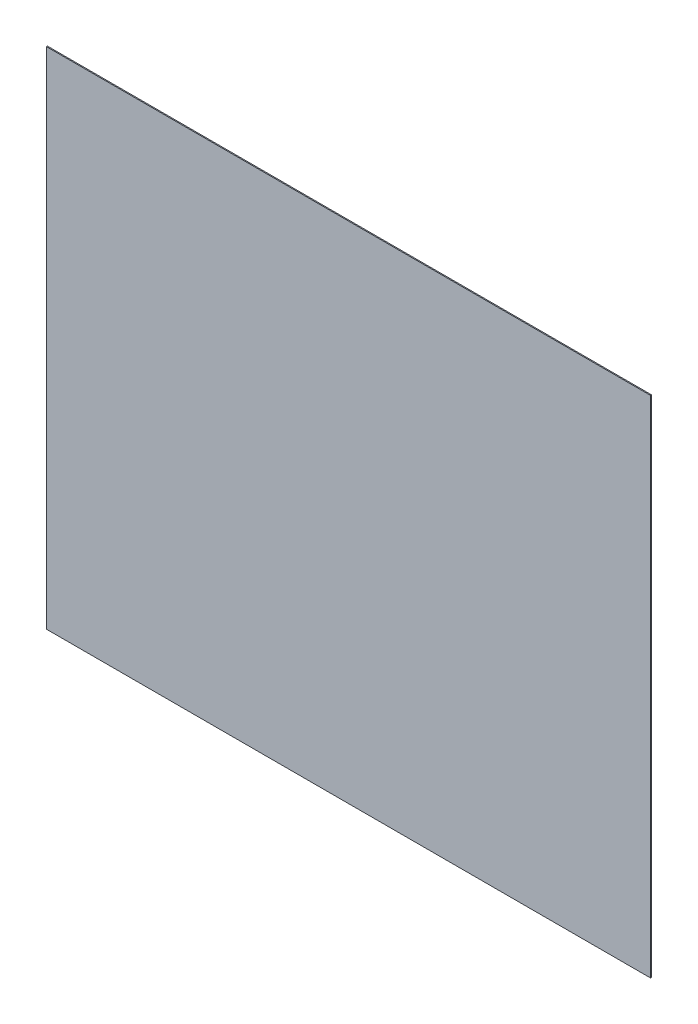
ISO-10303-21;
HEADER;
FILE_DESCRIPTION(('STEP AP214'),'2;1');
FILE_NAME('part.step','',(''),(''),'','','');
FILE_SCHEMA(('AUTOMOTIVE_DESIGN { 1 0 10303 214 1 1 1 1 }'));
ENDSEC;
DATA;
#1=APPLICATION_CONTEXT('core data for automotive mechanical design processes');
#2=APPLICATION_PROTOCOL_DEFINITION('international standard','automotive_design',2000,#1);
#3=PRODUCT_CONTEXT('',#1,'mechanical');
#4=PRODUCT('Part','Part','',(#3));
#5=PRODUCT_RELATED_PRODUCT_CATEGORY('part','',(#4));
#6=PRODUCT_DEFINITION_FORMATION('','',#4);
#7=PRODUCT_DEFINITION_CONTEXT('part definition',#1,'design');
#8=PRODUCT_DEFINITION('design','',#6,#7);
#9=PRODUCT_DEFINITION_SHAPE('','',#8);
#10=(LENGTH_UNIT() NAMED_UNIT(*) SI_UNIT(.MILLI.,.METRE.));
#11=(NAMED_UNIT(*) PLANE_ANGLE_UNIT() SI_UNIT($,.RADIAN.));
#12=(NAMED_UNIT(*) SI_UNIT($,.STERADIAN.) SOLID_ANGLE_UNIT());
#13=UNCERTAINTY_MEASURE_WITH_UNIT(LENGTH_MEASURE(1.E-05),#10,'distance_accuracy_value','');
#14=(GEOMETRIC_REPRESENTATION_CONTEXT(3) GLOBAL_UNCERTAINTY_ASSIGNED_CONTEXT((#13)) GLOBAL_UNIT_ASSIGNED_CONTEXT((#10,
#11,#12)) REPRESENTATION_CONTEXT('',''));
#15=CARTESIAN_POINT('',(0.,0.,0.));
#16=DIRECTION('',(0.,0.,1.));
#17=DIRECTION('',(1.,0.,0.));
#18=AXIS2_PLACEMENT_3D('',#15,#16,#17);
#19=CARTESIAN_POINT('',(-2.031834983945E-05,9.246193160429E-06,0.00100076));
#20=DIRECTION('',(0.,0.,1.));
#21=DIRECTION('',(1.,0.,0.));
#22=AXIS2_PLACEMENT_3D('',#19,#20,#21);
#23=PLANE('',#22);
#24=DIRECTION('',(1.,0.,0.));
#25=VECTOR('',#24,1.);
#26=CARTESIAN_POINT('',(-0.29969968,-0.25022048,0.00100076));
#27=LINE('',#26,#25);
#28=CARTESIAN_POINT('',(-0.29969968,-0.25022048,0.00100076));
#29=VERTEX_POINT('',#28);
#30=CARTESIAN_POINT('',(0.2996184,-0.25022048,0.00100076));
#31=VERTEX_POINT('',#30);
#32=EDGE_CURVE('E95',#29,#31,#27,.T.);
#33=ORIENTED_EDGE('',*,*,#32,.T.);
#34=DIRECTION('',(0.000162416759274564,0.999999986810398,0.));
#35=VECTOR('',#34,1.);
#36=CARTESIAN_POINT('',(0.2996184,-0.25022048,0.00100076));
#37=LINE('',#36,#35);
#38=CARTESIAN_POINT('',(0.29969968,0.25022048,0.00100076));
#39=VERTEX_POINT('',#38);
#40=EDGE_CURVE('E91',#31,#39,#37,.T.);
#41=ORIENTED_EDGE('',*,*,#40,.T.);
#42=DIRECTION('',(-1.,0.,0.));
#43=VECTOR('',#42,1.);
#44=CARTESIAN_POINT('',(0.29969968,0.25022048,0.00100076));
#45=LINE('',#44,#43);
#46=CARTESIAN_POINT('',(-0.29969968,0.25022048,0.00100076));
#47=VERTEX_POINT('',#46);
#48=EDGE_CURVE('E113',#39,#47,#45,.T.);
#49=ORIENTED_EDGE('',*,*,#48,.T.);
#50=DIRECTION('',(0.,-1.,0.));
#51=VECTOR('',#50,1.);
#52=CARTESIAN_POINT('',(-0.29969968,0.25022048,0.00100076));
#53=LINE('',#52,#51);
#54=EDGE_CURVE('E11',#47,#29,#53,.T.);
#55=ORIENTED_EDGE('',*,*,#54,.T.);
#56=EDGE_LOOP('',(#33,#41,#49,#55));
#57=FACE_BOUND('',#56,.T.);
#58=ADVANCED_FACE('F17',(#57),#23,.T.);
#59=CARTESIAN_POINT('',(-2.031834983945E-05,9.246193160429E-06,0.));
#60=DIRECTION('',(0.,0.,1.));
#61=DIRECTION('',(1.,0.,0.));
#62=AXIS2_PLACEMENT_3D('',#59,#60,#61);
#63=PLANE('',#62);
#64=DIRECTION('',(0.,-1.,0.));
#65=VECTOR('',#64,1.);
#66=CARTESIAN_POINT('',(-0.29969968,0.25022048,0.));
#67=LINE('',#66,#65);
#68=CARTESIAN_POINT('',(-0.29969968,0.25022048,0.));
#69=VERTEX_POINT('',#68);
#70=CARTESIAN_POINT('',(-0.29969968,-0.25022048,0.));
#71=VERTEX_POINT('',#70);
#72=EDGE_CURVE('E26',#69,#71,#67,.T.);
#73=ORIENTED_EDGE('',*,*,#72,.F.);
#74=DIRECTION('',(-1.,0.,0.));
#75=VECTOR('',#74,1.);
#76=CARTESIAN_POINT('',(0.29969968,0.25022048,0.));
#77=LINE('',#76,#75);
#78=CARTESIAN_POINT('',(0.29969968,0.25022048,0.));
#79=VERTEX_POINT('',#78);
#80=EDGE_CURVE('E63',#79,#69,#77,.T.);
#81=ORIENTED_EDGE('',*,*,#80,.F.);
#82=DIRECTION('',(0.000162416759274564,0.999999986810398,0.));
#83=VECTOR('',#82,1.);
#84=CARTESIAN_POINT('',(0.2996184,-0.25022048,0.));
#85=LINE('',#84,#83);
#86=CARTESIAN_POINT('',(0.2996184,-0.25022048,0.));
#87=VERTEX_POINT('',#86);
#88=EDGE_CURVE('E77',#87,#79,#85,.T.);
#89=ORIENTED_EDGE('',*,*,#88,.F.);
#90=DIRECTION('',(1.,0.,0.));
#91=VECTOR('',#90,1.);
#92=CARTESIAN_POINT('',(-0.29969968,-0.25022048,0.));
#93=LINE('',#92,#91);
#94=EDGE_CURVE('E80',#71,#87,#93,.T.);
#95=ORIENTED_EDGE('',*,*,#94,.F.);
#96=EDGE_LOOP('',(#73,#81,#89,#95));
#97=FACE_BOUND('',#96,.T.);
#98=ADVANCED_FACE('F19',(#97),#63,.F.);
#99=CARTESIAN_POINT('',(-0.29969968,0.25022048,0.));
#100=DIRECTION('',(1.,0.,0.));
#101=DIRECTION('',(0.,1.,0.));
#102=AXIS2_PLACEMENT_3D('',#99,#100,#101);
#103=PLANE('',#102);
#104=ORIENTED_EDGE('',*,*,#72,.T.);
#105=DIRECTION('',(0.,0.,1.));
#106=VECTOR('',#105,1.);
#107=CARTESIAN_POINT('',(-0.29969968,-0.25022048,0.));
#108=LINE('',#107,#106);
#109=EDGE_CURVE('E85',#71,#29,#108,.T.);
#110=ORIENTED_EDGE('',*,*,#109,.T.);
#111=ORIENTED_EDGE('',*,*,#54,.F.);
#112=DIRECTION('',(0.,0.,1.));
#113=VECTOR('',#112,1.);
#114=CARTESIAN_POINT('',(-0.29969968,0.25022048,0.));
#115=LINE('',#114,#113);
#116=EDGE_CURVE('E115',#69,#47,#115,.T.);
#117=ORIENTED_EDGE('',*,*,#116,.F.);
#118=EDGE_LOOP('',(#104,#110,#111,#117));
#119=FACE_BOUND('',#118,.T.);
#120=ADVANCED_FACE('F151',(#119),#103,.F.);
#121=CARTESIAN_POINT('',(0.29969968,0.25022048,0.));
#122=DIRECTION('',(0.,-1.,0.));
#123=DIRECTION('',(0.,0.,-1.));
#124=AXIS2_PLACEMENT_3D('',#121,#122,#123);
#125=PLANE('',#124);
#126=ORIENTED_EDGE('',*,*,#80,.T.);
#127=ORIENTED_EDGE('',*,*,#116,.T.);
#128=ORIENTED_EDGE('',*,*,#48,.F.);
#129=DIRECTION('',(0.,0.,1.));
#130=VECTOR('',#129,1.);
#131=CARTESIAN_POINT('',(0.29969968,0.25022048,0.));
#132=LINE('',#131,#130);
#133=EDGE_CURVE('E84',#79,#39,#132,.T.);
#134=ORIENTED_EDGE('',*,*,#133,.F.);
#135=EDGE_LOOP('',(#126,#127,#128,#134));
#136=FACE_BOUND('',#135,.T.);
#137=ADVANCED_FACE('F135',(#136),#125,.F.);
#138=CARTESIAN_POINT('',(0.2996184,-0.25022048,0.));
#139=DIRECTION('',(-0.999999986810398,0.000162416759274564,0.));
#140=DIRECTION('',(0.,0.,1.));
#141=AXIS2_PLACEMENT_3D('',#138,#139,#140);
#142=PLANE('',#141);
#143=ORIENTED_EDGE('',*,*,#88,.T.);
#144=ORIENTED_EDGE('',*,*,#133,.T.);
#145=ORIENTED_EDGE('',*,*,#40,.F.);
#146=DIRECTION('',(0.,0.,1.));
#147=VECTOR('',#146,1.);
#148=CARTESIAN_POINT('',(0.2996184,-0.25022048,0.));
#149=LINE('',#148,#147);
#150=EDGE_CURVE('E88',#87,#31,#149,.T.);
#151=ORIENTED_EDGE('',*,*,#150,.F.);
#152=EDGE_LOOP('',(#143,#144,#145,#151));
#153=FACE_BOUND('',#152,.T.);
#154=ADVANCED_FACE('F89',(#153),#142,.F.);
#155=CARTESIAN_POINT('',(-0.29969968,-0.25022048,0.));
#156=DIRECTION('',(0.,1.,0.));
#157=DIRECTION('',(1.,0.,0.));
#158=AXIS2_PLACEMENT_3D('',#155,#156,#157);
#159=PLANE('',#158);
#160=ORIENTED_EDGE('',*,*,#94,.T.);
#161=ORIENTED_EDGE('',*,*,#150,.T.);
#162=ORIENTED_EDGE('',*,*,#32,.F.);
#163=ORIENTED_EDGE('',*,*,#109,.F.);
#164=EDGE_LOOP('',(#160,#161,#162,#163));
#165=FACE_BOUND('',#164,.T.);
#166=ADVANCED_FACE('F97',(#165),#159,.F.);
#167=CLOSED_SHELL('',(#58,#98,#120,#137,#154,#166));
#168=MANIFOLD_SOLID_BREP('B1',#167);
#169=ADVANCED_BREP_SHAPE_REPRESENTATION('',(#18,#168),#14);
#170=SHAPE_DEFINITION_REPRESENTATION(#9,#169);
ENDSEC;
END-ISO-10303-21;
